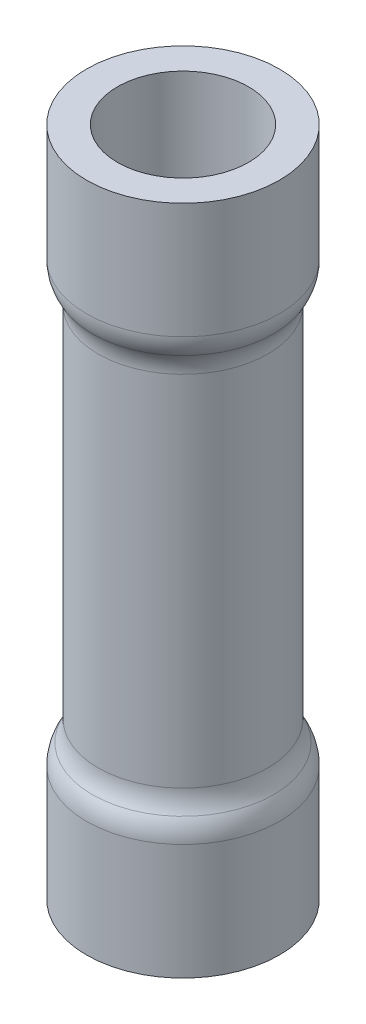
ISO-10303-21;
HEADER;
FILE_DESCRIPTION(('STEP AP214'),'2;1');
FILE_NAME('part.step','',(''),(''),'','','');
FILE_SCHEMA(('AUTOMOTIVE_DESIGN { 1 0 10303 214 1 1 1 1 }'));
ENDSEC;
DATA;
#1=APPLICATION_CONTEXT('core data for automotive mechanical design processes');
#2=APPLICATION_PROTOCOL_DEFINITION('international standard','automotive_design',2000,#1);
#3=PRODUCT_CONTEXT('',#1,'mechanical');
#4=PRODUCT('Part','Part','',(#3));
#5=PRODUCT_RELATED_PRODUCT_CATEGORY('part','',(#4));
#6=PRODUCT_DEFINITION_FORMATION('','',#4);
#7=PRODUCT_DEFINITION_CONTEXT('part definition',#1,'design');
#8=PRODUCT_DEFINITION('design','',#6,#7);
#9=PRODUCT_DEFINITION_SHAPE('','',#8);
#10=(LENGTH_UNIT() NAMED_UNIT(*) SI_UNIT(.MILLI.,.METRE.));
#11=(NAMED_UNIT(*) PLANE_ANGLE_UNIT() SI_UNIT($,.RADIAN.));
#12=(NAMED_UNIT(*) SI_UNIT($,.STERADIAN.) SOLID_ANGLE_UNIT());
#13=UNCERTAINTY_MEASURE_WITH_UNIT(LENGTH_MEASURE(1.E-05),#10,'distance_accuracy_value','');
#14=(GEOMETRIC_REPRESENTATION_CONTEXT(3) GLOBAL_UNCERTAINTY_ASSIGNED_CONTEXT((#13)) GLOBAL_UNIT_ASSIGNED_CONTEXT((#10,
#11,#12)) REPRESENTATION_CONTEXT('',''));
#15=CARTESIAN_POINT('',(0.,0.,0.));
#16=DIRECTION('',(0.,0.,1.));
#17=DIRECTION('',(1.,0.,0.));
#18=AXIS2_PLACEMENT_3D('',#15,#16,#17);
#19=CARTESIAN_POINT('',(0.,22.098,0.));
#20=DIRECTION('',(0.,1.,0.));
#21=DIRECTION('',(0.,0.,1.));
#22=AXIS2_PLACEMENT_3D('',#19,#20,#21);
#23=CYLINDRICAL_SURFACE('',#22,3.175);
#24=CARTESIAN_POINT('',(0.,22.098,0.));
#25=DIRECTION('',(0.,1.,0.));
#26=DIRECTION('',(0.,0.,1.));
#27=AXIS2_PLACEMENT_3D('',#24,#25,#26);
#28=CIRCLE('',#27,3.175);
#29=CARTESIAN_POINT('',(0.,22.098,3.175));
#30=VERTEX_POINT('',#29);
#31=EDGE_CURVE('E10',#30,#30,#28,.T.);
#32=ORIENTED_EDGE('',*,*,#31,.F.);
#33=EDGE_LOOP('',(#32));
#34=FACE_BOUND('',#33,.T.);
#35=CARTESIAN_POINT('',(0.,18.288,0.));
#36=DIRECTION('',(0.,1.,0.));
#37=DIRECTION('',(0.,0.,1.));
#38=AXIS2_PLACEMENT_3D('',#35,#36,#37);
#39=CIRCLE('',#38,3.175);
#40=CARTESIAN_POINT('',(0.,18.288,3.175));
#41=VERTEX_POINT('',#40);
#42=EDGE_CURVE('E82',#41,#41,#39,.T.);
#43=ORIENTED_EDGE('',*,*,#42,.T.);
#44=EDGE_LOOP('',(#43));
#45=FACE_BOUND('',#44,.T.);
#46=ADVANCED_FACE('F30',(#34,#45),#23,.T.);
#47=CARTESIAN_POINT('',(2.159,22.098,0.));
#48=DIRECTION('',(0.,1.,0.));
#49=DIRECTION('',(0.,0.,1.));
#50=AXIS2_PLACEMENT_3D('',#47,#48,#49);
#51=PLANE('',#50);
#52=ORIENTED_EDGE('',*,*,#31,.T.);
#53=EDGE_LOOP('',(#52));
#54=FACE_BOUND('',#53,.T.);
#55=CARTESIAN_POINT('',(0.,22.098,0.));
#56=DIRECTION('',(0.,1.,0.));
#57=DIRECTION('',(0.,0.,1.));
#58=AXIS2_PLACEMENT_3D('',#55,#56,#57);
#59=CIRCLE('',#58,2.159);
#60=CARTESIAN_POINT('',(0.,22.098,2.159));
#61=VERTEX_POINT('',#60);
#62=EDGE_CURVE('E36',#61,#61,#59,.T.);
#63=ORIENTED_EDGE('',*,*,#62,.F.);
#64=EDGE_LOOP('',(#63));
#65=FACE_BOUND('',#64,.T.);
#66=ADVANCED_FACE('F135',(#54,#65),#51,.T.);
#67=CARTESIAN_POINT('',(0.,22.098,0.));
#68=DIRECTION('',(0.,1.,0.));
#69=DIRECTION('',(0.,0.,1.));
#70=AXIS2_PLACEMENT_3D('',#67,#68,#69);
#71=CYLINDRICAL_SURFACE('',#70,2.159);
#72=ORIENTED_EDGE('',*,*,#62,.T.);
#73=EDGE_LOOP('',(#72));
#74=FACE_BOUND('',#73,.T.);
#75=CARTESIAN_POINT('',(0.,18.288,0.));
#76=DIRECTION('',(0.,1.,0.));
#77=DIRECTION('',(0.,0.,1.));
#78=AXIS2_PLACEMENT_3D('',#75,#76,#77);
#79=CIRCLE('',#78,2.159);
#80=CARTESIAN_POINT('',(0.,18.288,2.159));
#81=VERTEX_POINT('',#80);
#82=EDGE_CURVE('E40',#81,#81,#79,.T.);
#83=ORIENTED_EDGE('',*,*,#82,.F.);
#84=EDGE_LOOP('',(#83));
#85=FACE_BOUND('',#84,.T.);
#86=ADVANCED_FACE('F140',(#74,#85),#71,.F.);
#87=CARTESIAN_POINT('',(0.,18.288,0.));
#88=DIRECTION('',(0.,1.,0.));
#89=DIRECTION('',(0.,0.,1.));
#90=AXIS2_PLACEMENT_3D('',#87,#88,#89);
#91=TOROIDAL_SURFACE('',#90,1.905,0.253999999999999);
#92=ORIENTED_EDGE('',*,*,#82,.T.);
#93=EDGE_LOOP('',(#92));
#94=FACE_BOUND('',#93,.T.);
#95=CARTESIAN_POINT('',(0.,18.1541971973388,0.));
#96=DIRECTION('',(0.,1.,0.));
#97=DIRECTION('',(0.,0.,1.));
#98=AXIS2_PLACEMENT_3D('',#95,#96,#97);
#99=CIRCLE('',#98,2.1209);
#100=CARTESIAN_POINT('',(0.,18.1541971973388,2.1209));
#101=VERTEX_POINT('',#100);
#102=EDGE_CURVE('E44',#101,#101,#99,.T.);
#103=ORIENTED_EDGE('',*,*,#102,.F.);
#104=EDGE_LOOP('',(#103));
#105=FACE_BOUND('',#104,.T.);
#106=ADVANCED_FACE('F144',(#94,#105),#91,.F.);
#107=CARTESIAN_POINT('',(0.,16.9499719733877,0.));
#108=DIRECTION('',(0.,1.,0.));
#109=DIRECTION('',(0.,0.,1.));
#110=AXIS2_PLACEMENT_3D('',#107,#108,#109);
#111=TOROIDAL_SURFACE('',#110,4.064,2.286);
#112=ORIENTED_EDGE('',*,*,#102,.T.);
#113=EDGE_LOOP('',(#112));
#114=FACE_BOUND('',#113,.T.);
#115=CARTESIAN_POINT('',(0.,16.9499719733877,0.));
#116=DIRECTION('',(0.,1.,0.));
#117=DIRECTION('',(0.,0.,1.));
#118=AXIS2_PLACEMENT_3D('',#115,#116,#117);
#119=CIRCLE('',#118,1.778);
#120=CARTESIAN_POINT('',(0.,16.9499719733877,1.778));
#121=VERTEX_POINT('',#120);
#122=EDGE_CURVE('E49',#121,#121,#119,.T.);
#123=ORIENTED_EDGE('',*,*,#122,.F.);
#124=EDGE_LOOP('',(#123));
#125=FACE_BOUND('',#124,.T.);
#126=ADVANCED_FACE('F150',(#114,#125),#111,.T.);
#127=CARTESIAN_POINT('',(0.,22.098,0.));
#128=DIRECTION('',(0.,1.,0.));
#129=DIRECTION('',(0.,0.,1.));
#130=AXIS2_PLACEMENT_3D('',#127,#128,#129);
#131=CYLINDRICAL_SURFACE('',#130,1.778);
#132=ORIENTED_EDGE('',*,*,#122,.T.);
#133=EDGE_LOOP('',(#132));
#134=FACE_BOUND('',#133,.T.);
#135=CARTESIAN_POINT('',(0.,5.14802802661229,0.));
#136=DIRECTION('',(0.,1.,0.));
#137=DIRECTION('',(0.,0.,1.));
#138=AXIS2_PLACEMENT_3D('',#135,#136,#137);
#139=CIRCLE('',#138,1.778);
#140=CARTESIAN_POINT('',(0.,5.14802802661229,1.778));
#141=VERTEX_POINT('',#140);
#142=EDGE_CURVE('E52',#141,#141,#139,.T.);
#143=ORIENTED_EDGE('',*,*,#142,.F.);
#144=EDGE_LOOP('',(#143));
#145=FACE_BOUND('',#144,.T.);
#146=ADVANCED_FACE('F154',(#134,#145),#131,.F.);
#147=CARTESIAN_POINT('',(0.,5.14802802661229,0.));
#148=DIRECTION('',(0.,1.,0.));
#149=DIRECTION('',(0.,0.,1.));
#150=AXIS2_PLACEMENT_3D('',#147,#148,#149);
#151=TOROIDAL_SURFACE('',#150,4.064,2.286);
#152=ORIENTED_EDGE('',*,*,#142,.T.);
#153=EDGE_LOOP('',(#152));
#154=FACE_BOUND('',#153,.T.);
#155=CARTESIAN_POINT('',(0.,3.94380280266123,0.));
#156=DIRECTION('',(0.,1.,0.));
#157=DIRECTION('',(0.,0.,1.));
#158=AXIS2_PLACEMENT_3D('',#155,#156,#157);
#159=CIRCLE('',#158,2.1209);
#160=CARTESIAN_POINT('',(0.,3.94380280266123,2.1209));
#161=VERTEX_POINT('',#160);
#162=EDGE_CURVE('E55',#161,#161,#159,.T.);
#163=ORIENTED_EDGE('',*,*,#162,.F.);
#164=EDGE_LOOP('',(#163));
#165=FACE_BOUND('',#164,.T.);
#166=ADVANCED_FACE('F158',(#154,#165),#151,.T.);
#167=CARTESIAN_POINT('',(0.,3.81,0.));
#168=DIRECTION('',(0.,1.,0.));
#169=DIRECTION('',(0.,0.,1.));
#170=AXIS2_PLACEMENT_3D('',#167,#168,#169);
#171=TOROIDAL_SURFACE('',#170,1.905,0.254);
#172=ORIENTED_EDGE('',*,*,#162,.T.);
#173=EDGE_LOOP('',(#172));
#174=FACE_BOUND('',#173,.T.);
#175=CARTESIAN_POINT('',(0.,3.81,0.));
#176=DIRECTION('',(0.,1.,0.));
#177=DIRECTION('',(0.,0.,1.));
#178=AXIS2_PLACEMENT_3D('',#175,#176,#177);
#179=CIRCLE('',#178,2.159);
#180=CARTESIAN_POINT('',(0.,3.81,2.159));
#181=VERTEX_POINT('',#180);
#182=EDGE_CURVE('E58',#181,#181,#179,.T.);
#183=ORIENTED_EDGE('',*,*,#182,.F.);
#184=EDGE_LOOP('',(#183));
#185=FACE_BOUND('',#184,.T.);
#186=ADVANCED_FACE('F131',(#174,#185),#171,.F.);
#187=CARTESIAN_POINT('',(0.,22.098,0.));
#188=DIRECTION('',(0.,1.,0.));
#189=DIRECTION('',(0.,0.,1.));
#190=AXIS2_PLACEMENT_3D('',#187,#188,#189);
#191=CYLINDRICAL_SURFACE('',#190,2.159);
#192=ORIENTED_EDGE('',*,*,#182,.T.);
#193=EDGE_LOOP('',(#192));
#194=FACE_BOUND('',#193,.T.);
#195=CARTESIAN_POINT('',(0.,0.,0.));
#196=DIRECTION('',(0.,1.,0.));
#197=DIRECTION('',(0.,0.,1.));
#198=AXIS2_PLACEMENT_3D('',#195,#196,#197);
#199=CIRCLE('',#198,2.159);
#200=CARTESIAN_POINT('',(0.,0.,2.159));
#201=VERTEX_POINT('',#200);
#202=EDGE_CURVE('E61',#201,#201,#199,.T.);
#203=ORIENTED_EDGE('',*,*,#202,.F.);
#204=EDGE_LOOP('',(#203));
#205=FACE_BOUND('',#204,.T.);
#206=ADVANCED_FACE('F125',(#194,#205),#191,.F.);
#207=CARTESIAN_POINT('',(3.175,0.,0.));
#208=DIRECTION('',(0.,-1.,0.));
#209=DIRECTION('',(0.,0.,-1.));
#210=AXIS2_PLACEMENT_3D('',#207,#208,#209);
#211=PLANE('',#210);
#212=ORIENTED_EDGE('',*,*,#202,.T.);
#213=EDGE_LOOP('',(#212));
#214=FACE_BOUND('',#213,.T.);
#215=CARTESIAN_POINT('',(0.,0.,0.));
#216=DIRECTION('',(0.,1.,0.));
#217=DIRECTION('',(0.,0.,1.));
#218=AXIS2_PLACEMENT_3D('',#215,#216,#217);
#219=CIRCLE('',#218,3.175);
#220=CARTESIAN_POINT('',(0.,0.,3.175));
#221=VERTEX_POINT('',#220);
#222=EDGE_CURVE('E64',#221,#221,#219,.T.);
#223=ORIENTED_EDGE('',*,*,#222,.F.);
#224=EDGE_LOOP('',(#223));
#225=FACE_BOUND('',#224,.T.);
#226=ADVANCED_FACE('F120',(#214,#225),#211,.T.);
#227=CARTESIAN_POINT('',(0.,22.098,0.));
#228=DIRECTION('',(0.,1.,0.));
#229=DIRECTION('',(0.,0.,1.));
#230=AXIS2_PLACEMENT_3D('',#227,#228,#229);
#231=CYLINDRICAL_SURFACE('',#230,3.175);
#232=CARTESIAN_POINT('',(0.,3.81,0.));
#233=DIRECTION('',(0.,1.,0.));
#234=DIRECTION('',(0.,0.,1.));
#235=AXIS2_PLACEMENT_3D('',#232,#233,#234);
#236=CIRCLE('',#235,3.175);
#237=CARTESIAN_POINT('',(0.,3.81,3.175));
#238=VERTEX_POINT('',#237);
#239=EDGE_CURVE('E67',#238,#238,#236,.T.);
#240=ORIENTED_EDGE('',*,*,#239,.F.);
#241=EDGE_LOOP('',(#240));
#242=FACE_BOUND('',#241,.T.);
#243=ORIENTED_EDGE('',*,*,#222,.T.);
#244=EDGE_LOOP('',(#243));
#245=FACE_BOUND('',#244,.T.);
#246=ADVANCED_FACE('F114',(#242,#245),#231,.T.);
#247=CARTESIAN_POINT('',(0.,3.81,0.));
#248=DIRECTION('',(0.,1.,0.));
#249=DIRECTION('',(0.,0.,1.));
#250=AXIS2_PLACEMENT_3D('',#247,#248,#249);
#251=TOROIDAL_SURFACE('',#250,1.905,1.27);
#252=CARTESIAN_POINT('',(0.,4.47901401330614,0.));
#253=DIRECTION('',(0.,1.,0.));
#254=DIRECTION('',(0.,0.,1.));
#255=AXIS2_PLACEMENT_3D('',#252,#253,#254);
#256=CIRCLE('',#255,2.9845);
#257=CARTESIAN_POINT('',(0.,4.47901401330614,2.9845));
#258=VERTEX_POINT('',#257);
#259=EDGE_CURVE('E70',#258,#258,#256,.T.);
#260=ORIENTED_EDGE('',*,*,#259,.F.);
#261=EDGE_LOOP('',(#260));
#262=FACE_BOUND('',#261,.T.);
#263=ORIENTED_EDGE('',*,*,#239,.T.);
#264=EDGE_LOOP('',(#263));
#265=FACE_BOUND('',#264,.T.);
#266=ADVANCED_FACE('F108',(#262,#265),#251,.T.);
#267=CARTESIAN_POINT('',(0.,5.14802802661229,0.));
#268=DIRECTION('',(0.,1.,0.));
#269=DIRECTION('',(0.,0.,1.));
#270=AXIS2_PLACEMENT_3D('',#267,#268,#269);
#271=TOROIDAL_SURFACE('',#270,4.064,1.27);
#272=CARTESIAN_POINT('',(0.,5.14802802661229,0.));
#273=DIRECTION('',(0.,1.,0.));
#274=DIRECTION('',(0.,0.,1.));
#275=AXIS2_PLACEMENT_3D('',#272,#273,#274);
#276=CIRCLE('',#275,2.794);
#277=CARTESIAN_POINT('',(0.,5.14802802661229,2.794));
#278=VERTEX_POINT('',#277);
#279=EDGE_CURVE('E73',#278,#278,#276,.T.);
#280=ORIENTED_EDGE('',*,*,#279,.F.);
#281=EDGE_LOOP('',(#280));
#282=FACE_BOUND('',#281,.T.);
#283=ORIENTED_EDGE('',*,*,#259,.T.);
#284=EDGE_LOOP('',(#283));
#285=FACE_BOUND('',#284,.T.);
#286=ADVANCED_FACE('F102',(#282,#285),#271,.F.);
#287=CARTESIAN_POINT('',(0.,22.098,0.));
#288=DIRECTION('',(0.,1.,0.));
#289=DIRECTION('',(0.,0.,1.));
#290=AXIS2_PLACEMENT_3D('',#287,#288,#289);
#291=CYLINDRICAL_SURFACE('',#290,2.794);
#292=CARTESIAN_POINT('',(0.,16.9499719733877,0.));
#293=DIRECTION('',(0.,1.,0.));
#294=DIRECTION('',(0.,0.,1.));
#295=AXIS2_PLACEMENT_3D('',#292,#293,#294);
#296=CIRCLE('',#295,2.794);
#297=CARTESIAN_POINT('',(0.,16.9499719733877,2.794));
#298=VERTEX_POINT('',#297);
#299=EDGE_CURVE('E76',#298,#298,#296,.T.);
#300=ORIENTED_EDGE('',*,*,#299,.F.);
#301=EDGE_LOOP('',(#300));
#302=FACE_BOUND('',#301,.T.);
#303=ORIENTED_EDGE('',*,*,#279,.T.);
#304=EDGE_LOOP('',(#303));
#305=FACE_BOUND('',#304,.T.);
#306=ADVANCED_FACE('F96',(#302,#305),#291,.T.);
#307=CARTESIAN_POINT('',(0.,16.9499719733877,0.));
#308=DIRECTION('',(0.,1.,0.));
#309=DIRECTION('',(0.,0.,1.));
#310=AXIS2_PLACEMENT_3D('',#307,#308,#309);
#311=TOROIDAL_SURFACE('',#310,4.064,1.27);
#312=CARTESIAN_POINT('',(0.,17.6189859866939,0.));
#313=DIRECTION('',(0.,1.,0.));
#314=DIRECTION('',(0.,0.,1.));
#315=AXIS2_PLACEMENT_3D('',#312,#313,#314);
#316=CIRCLE('',#315,2.9845);
#317=CARTESIAN_POINT('',(0.,17.6189859866939,2.9845));
#318=VERTEX_POINT('',#317);
#319=EDGE_CURVE('E79',#318,#318,#316,.T.);
#320=ORIENTED_EDGE('',*,*,#319,.F.);
#321=EDGE_LOOP('',(#320));
#322=FACE_BOUND('',#321,.T.);
#323=ORIENTED_EDGE('',*,*,#299,.T.);
#324=EDGE_LOOP('',(#323));
#325=FACE_BOUND('',#324,.T.);
#326=ADVANCED_FACE('F90',(#322,#325),#311,.F.);
#327=CARTESIAN_POINT('',(0.,18.288,0.));
#328=DIRECTION('',(0.,1.,0.));
#329=DIRECTION('',(0.,0.,1.));
#330=AXIS2_PLACEMENT_3D('',#327,#328,#329);
#331=TOROIDAL_SURFACE('',#330,1.905,1.27);
#332=ORIENTED_EDGE('',*,*,#42,.F.);
#333=EDGE_LOOP('',(#332));
#334=FACE_BOUND('',#333,.T.);
#335=ORIENTED_EDGE('',*,*,#319,.T.);
#336=EDGE_LOOP('',(#335));
#337=FACE_BOUND('',#336,.T.);
#338=ADVANCED_FACE('F87',(#334,#337),#331,.T.);
#339=CLOSED_SHELL('',(#46,#66,#86,#106,#126,#146,#166,#186,#206,#226,#246,#266,#286,#306,#326,#338));
#340=MANIFOLD_SOLID_BREP('B2',#339);
#341=ADVANCED_BREP_SHAPE_REPRESENTATION('',(#18,#340),#14);
#342=SHAPE_DEFINITION_REPRESENTATION(#9,#341);
ENDSEC;
END-ISO-10303-21;
